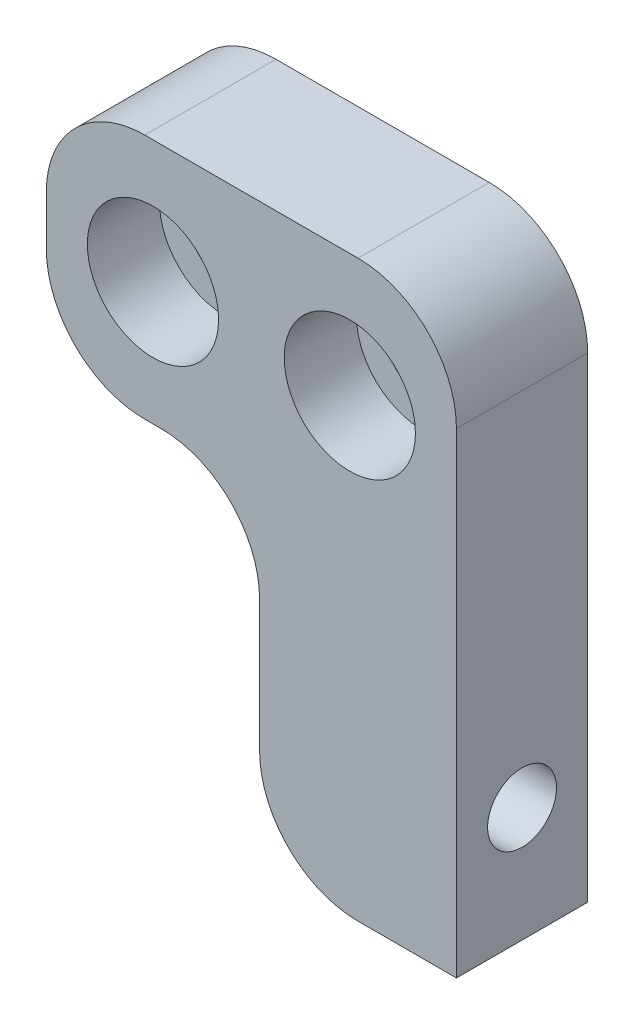
ISO-10303-21;
HEADER;
FILE_DESCRIPTION(('STEP AP214'),'2;1');
FILE_NAME('part.step','',(''),(''),'','','');
FILE_SCHEMA(('AUTOMOTIVE_DESIGN { 1 0 10303 214 1 1 1 1 }'));
ENDSEC;
DATA;
#1=APPLICATION_CONTEXT('core data for automotive mechanical design processes');
#2=APPLICATION_PROTOCOL_DEFINITION('international standard','automotive_design',2000,#1);
#3=PRODUCT_CONTEXT('',#1,'mechanical');
#4=PRODUCT('Part','Part','',(#3));
#5=PRODUCT_RELATED_PRODUCT_CATEGORY('part','',(#4));
#6=PRODUCT_DEFINITION_FORMATION('','',#4);
#7=PRODUCT_DEFINITION_CONTEXT('part definition',#1,'design');
#8=PRODUCT_DEFINITION('design','',#6,#7);
#9=PRODUCT_DEFINITION_SHAPE('','',#8);
#10=(LENGTH_UNIT() NAMED_UNIT(*) SI_UNIT(.MILLI.,.METRE.));
#11=(NAMED_UNIT(*) PLANE_ANGLE_UNIT() SI_UNIT($,.RADIAN.));
#12=(NAMED_UNIT(*) SI_UNIT($,.STERADIAN.) SOLID_ANGLE_UNIT());
#13=UNCERTAINTY_MEASURE_WITH_UNIT(LENGTH_MEASURE(1.E-05),#10,'distance_accuracy_value','');
#14=(GEOMETRIC_REPRESENTATION_CONTEXT(3) GLOBAL_UNCERTAINTY_ASSIGNED_CONTEXT((#13)) GLOBAL_UNIT_ASSIGNED_CONTEXT((#10,
#11,#12)) REPRESENTATION_CONTEXT('',''));
#15=CARTESIAN_POINT('',(0.,0.,0.));
#16=DIRECTION('',(0.,0.,1.));
#17=DIRECTION('',(1.,0.,0.));
#18=AXIS2_PLACEMENT_3D('',#15,#16,#17);
#19=CARTESIAN_POINT('',(6.,6.,8.));
#20=DIRECTION('',(0.,0.,-1.));
#21=DIRECTION('',(-1.,0.,0.));
#22=AXIS2_PLACEMENT_3D('',#19,#20,#21);
#23=CYLINDRICAL_SURFACE('',#22,6.);
#24=DIRECTION('',(0.,0.,-1.));
#25=VECTOR('',#24,1.);
#26=CARTESIAN_POINT('',(0.,6.00000000000004,8.));
#27=LINE('',#26,#25);
#28=CARTESIAN_POINT('',(0.,6.00000000000004,8.));
#29=VERTEX_POINT('',#28);
#30=CARTESIAN_POINT('',(0.,6.00000000000004,5.84661853126196));
#31=VERTEX_POINT('',#30);
#32=EDGE_CURVE('E191',#29,#31,#27,.T.);
#33=ORIENTED_EDGE('',*,*,#32,.T.);
#34=CARTESIAN_POINT('',(0.,6.00000000000004,5.84661853126196));
#35=CARTESIAN_POINT('',(-2.42123116743618E-06,5.94841264548622,5.81868309843425));
#36=CARTESIAN_POINT('',(0.000665680960310724,5.89802565774913,5.78859909007181));
#37=CARTESIAN_POINT('',(0.0031351324375642,5.79997255383219,5.72434664893265));
#38=CARTESIAN_POINT('',(0.0049362119838493,5.75230579296558,5.69017918991266));
#39=CARTESIAN_POINT('',(0.011718000597348,5.61403192308251,5.58200718641706));
#40=CARTESIAN_POINT('',(0.0180790757252985,5.52792266435418,5.50220885330978));
#41=CARTESIAN_POINT('',(0.0326072898947515,5.37030437726796,5.32957583204139));
#42=CARTESIAN_POINT('',(0.0407739569979629,5.29879154313208,5.23674455268875));
#43=CARTESIAN_POINT('',(0.057042321229305,5.1721490550708,5.0404773814718));
#44=CARTESIAN_POINT('',(0.0651440135927151,5.11702059214447,4.93704071942453));
#45=CARTESIAN_POINT('',(0.079708292714416,5.02408889902686,4.72095996515105));
#46=CARTESIAN_POINT('',(0.0861485937918625,4.98651623826522,4.60821504394805));
#47=CARTESIAN_POINT('',(0.0959507971643301,4.93088317491521,4.37787442915162));
#48=CARTESIAN_POINT('',(0.0993128488957042,4.91282182512524,4.26027897132147));
#49=CARTESIAN_POINT('',(0.102270451998787,4.89688975243749,4.025177083098));
#50=CARTESIAN_POINT('',(0.101913075949484,4.89876669940903,3.90768831649214));
#51=CARTESIAN_POINT('',(0.0976153986928007,4.92204267563766,3.67474046753528));
#52=CARTESIAN_POINT('',(0.0936753884410407,4.94344011958174,3.5592812211375));
#53=CARTESIAN_POINT('',(0.0830156192227075,5.00488625856486,3.33439993334599));
#54=CARTESIAN_POINT('',(0.076314175706878,5.04481227737298,3.22494339919144));
#55=CARTESIAN_POINT('',(0.0614389818738308,5.14215163962482,3.01416028613101));
#56=CARTESIAN_POINT('',(0.0532646037755466,5.19957244677906,2.91283720051192));
#57=CARTESIAN_POINT('',(0.0369916681307225,5.3314124738807,2.71947652871819));
#58=CARTESIAN_POINT('',(0.0288965413055166,5.40609452612611,2.62761806151385));
#59=CARTESIAN_POINT('',(0.014877200802447,5.56986749156554,2.45773026355144));
#60=CARTESIAN_POINT('',(0.00894983194418875,5.6589371888568,2.37968091972755));
#61=CARTESIAN_POINT('',(0.00344158708830425,5.79303897891784,2.28080689923267));
#62=CARTESIAN_POINT('',(0.00217792318057366,5.83320921098646,2.25329682507167));
#63=CARTESIAN_POINT('',(0.000457407379120339,5.91531314554378,2.20116394377746));
#64=CARTESIAN_POINT('',(-6.50775293708018E-07,5.95724411505752,2.17653687153262));
#65=CARTESIAN_POINT('',(0.,6.00000000000004,2.15338146873804));
#66=B_SPLINE_CURVE_WITH_KNOTS('',3,(#34,#35,#36,#37,#38,#39,#40,#41,#42,#43,#44,#45,#46,#47,#48,
#49,#50,#51,#52,#53,#54,#55,#56,#57,#58,#59,#60,#61,#62,#63,#64,#65),.UNSPECIFIED.,.F.,.F.,(4,2,
2,2,2,2,2,2,2,2,2,2,2,2,2,4),(0.,0.175879430045885,0.351717002519302,0.702621996536343,
1.05343538063413,1.40427425953297,1.759599647918,2.1149077858012,2.46572471608605,
2.81651315810326,3.1650114860965,3.51365870080047,3.86801224951981,4.22184796302644,
4.3678577940385,4.513648812873),.UNSPECIFIED.);
#67=CARTESIAN_POINT('',(0.,6.00000000000004,2.15338146873804));
#68=VERTEX_POINT('',#67);
#69=EDGE_CURVE('E11',#31,#68,#66,.T.);
#70=ORIENTED_EDGE('',*,*,#69,.T.);
#71=CARTESIAN_POINT('',(0.,6.00000000000004,0.));
#72=VERTEX_POINT('',#71);
#73=EDGE_CURVE('E108',#68,#72,#27,.T.);
#74=ORIENTED_EDGE('',*,*,#73,.T.);
#75=CARTESIAN_POINT('',(6.,6.,0.));
#76=DIRECTION('',(0.,0.,1.));
#77=DIRECTION('',(1.,0.,0.));
#78=AXIS2_PLACEMENT_3D('',#75,#76,#77);
#79=CIRCLE('',#78,6.);
#80=CARTESIAN_POINT('',(6.00000000000004,0.,0.));
#81=VERTEX_POINT('',#80);
#82=EDGE_CURVE('E168',#72,#81,#79,.T.);
#83=ORIENTED_EDGE('',*,*,#82,.T.);
#84=DIRECTION('',(0.,0.,-1.));
#85=VECTOR('',#84,1.);
#86=CARTESIAN_POINT('',(6.00000000000004,0.,8.));
#87=LINE('',#86,#85);
#88=CARTESIAN_POINT('',(6.00000000000004,0.,8.));
#89=VERTEX_POINT('',#88);
#90=EDGE_CURVE('E52',#89,#81,#87,.T.);
#91=ORIENTED_EDGE('',*,*,#90,.F.);
#92=CARTESIAN_POINT('',(6.,6.,8.));
#93=DIRECTION('',(0.,0.,1.));
#94=DIRECTION('',(1.,0.,0.));
#95=AXIS2_PLACEMENT_3D('',#92,#93,#94);
#96=CIRCLE('',#95,6.);
#97=EDGE_CURVE('E190',#29,#89,#96,.T.);
#98=ORIENTED_EDGE('',*,*,#97,.F.);
#99=EDGE_LOOP('',(#33,#70,#74,#83,#91,#98));
#100=FACE_BOUND('',#99,.T.);
#101=ADVANCED_FACE('F39',(#100),#23,.T.);
#102=CARTESIAN_POINT('',(12.,0.,8.));
#103=DIRECTION('',(0.,1.,0.));
#104=DIRECTION('',(-1.,0.,0.));
#105=AXIS2_PLACEMENT_3D('',#102,#103,#104);
#106=PLANE('',#105);
#107=DIRECTION('',(1.,0.,0.));
#108=VECTOR('',#107,1.);
#109=CARTESIAN_POINT('',(12.,0.,0.));
#110=LINE('',#109,#108);
#111=CARTESIAN_POINT('',(12.,0.,0.));
#112=VERTEX_POINT('',#111);
#113=EDGE_CURVE('E170',#81,#112,#110,.T.);
#114=ORIENTED_EDGE('',*,*,#113,.T.);
#115=DIRECTION('',(0.,0.,-1.));
#116=VECTOR('',#115,1.);
#117=CARTESIAN_POINT('',(12.,0.,8.));
#118=LINE('',#117,#116);
#119=CARTESIAN_POINT('',(12.,0.,8.));
#120=VERTEX_POINT('',#119);
#121=EDGE_CURVE('E211',#120,#112,#118,.T.);
#122=ORIENTED_EDGE('',*,*,#121,.F.);
#123=DIRECTION('',(1.,0.,0.));
#124=VECTOR('',#123,1.);
#125=CARTESIAN_POINT('',(12.,0.,8.));
#126=LINE('',#125,#124);
#127=EDGE_CURVE('E117',#89,#120,#126,.T.);
#128=ORIENTED_EDGE('',*,*,#127,.F.);
#129=ORIENTED_EDGE('',*,*,#90,.T.);
#130=EDGE_LOOP('',(#114,#122,#128,#129));
#131=FACE_BOUND('',#130,.T.);
#132=ADVANCED_FACE('F214',(#131),#106,.F.);
#133=CARTESIAN_POINT('',(12.,29.,8.));
#134=DIRECTION('',(-1.,0.,0.));
#135=DIRECTION('',(0.,-1.,0.));
#136=AXIS2_PLACEMENT_3D('',#133,#134,#135);
#137=PLANE('',#136);
#138=CARTESIAN_POINT('',(12.,7.,4.));
#139=DIRECTION('',(1.,0.,0.));
#140=DIRECTION('',(0.,0.,-1.));
#141=AXIS2_PLACEMENT_3D('',#138,#139,#140);
#142=CIRCLE('',#141,2.1);
#143=CARTESIAN_POINT('',(12.,7.,1.9));
#144=VERTEX_POINT('',#143);
#145=EDGE_CURVE('E281',#144,#144,#142,.T.);
#146=ORIENTED_EDGE('',*,*,#145,.F.);
#147=EDGE_LOOP('',(#146));
#148=FACE_BOUND('',#147,.T.);
#149=DIRECTION('',(0.,1.,0.));
#150=VECTOR('',#149,1.);
#151=CARTESIAN_POINT('',(12.,29.,0.));
#152=LINE('',#151,#150);
#153=CARTESIAN_POINT('',(12.,29.,0.));
#154=VERTEX_POINT('',#153);
#155=EDGE_CURVE('E173',#112,#154,#152,.T.);
#156=ORIENTED_EDGE('',*,*,#155,.T.);
#157=DIRECTION('',(0.,0.,-1.));
#158=VECTOR('',#157,1.);
#159=CARTESIAN_POINT('',(12.,29.,8.));
#160=LINE('',#159,#158);
#161=CARTESIAN_POINT('',(12.,29.,8.));
#162=VERTEX_POINT('',#161);
#163=EDGE_CURVE('E208',#162,#154,#160,.T.);
#164=ORIENTED_EDGE('',*,*,#163,.F.);
#165=DIRECTION('',(0.,1.,0.));
#166=VECTOR('',#165,1.);
#167=CARTESIAN_POINT('',(12.,29.,8.));
#168=LINE('',#167,#166);
#169=EDGE_CURVE('E234',#120,#162,#168,.T.);
#170=ORIENTED_EDGE('',*,*,#169,.F.);
#171=ORIENTED_EDGE('',*,*,#121,.T.);
#172=EDGE_LOOP('',(#156,#164,#170,#171));
#173=FACE_BOUND('',#172,.T.);
#174=ADVANCED_FACE('F225',(#148,#173),#137,.F.);
#175=CARTESIAN_POINT('',(6.,29.,8.));
#176=DIRECTION('',(0.,0.,-1.));
#177=DIRECTION('',(-1.,0.,0.));
#178=AXIS2_PLACEMENT_3D('',#175,#176,#177);
#179=CYLINDRICAL_SURFACE('',#178,6.);
#180=CARTESIAN_POINT('',(6.,29.,0.));
#181=DIRECTION('',(0.,0.,1.));
#182=DIRECTION('',(-1.,0.,0.));
#183=AXIS2_PLACEMENT_3D('',#180,#181,#182);
#184=CIRCLE('',#183,6.);
#185=CARTESIAN_POINT('',(6.,35.,0.));
#186=VERTEX_POINT('',#185);
#187=EDGE_CURVE('E175',#154,#186,#184,.T.);
#188=ORIENTED_EDGE('',*,*,#187,.T.);
#189=DIRECTION('',(0.,0.,-1.));
#190=VECTOR('',#189,1.);
#191=CARTESIAN_POINT('',(6.,35.,8.));
#192=LINE('',#191,#190);
#193=CARTESIAN_POINT('',(6.,35.,8.));
#194=VERTEX_POINT('',#193);
#195=EDGE_CURVE('E205',#194,#186,#192,.T.);
#196=ORIENTED_EDGE('',*,*,#195,.F.);
#197=CARTESIAN_POINT('',(6.,29.,8.));
#198=DIRECTION('',(0.,0.,1.));
#199=DIRECTION('',(-1.,0.,0.));
#200=AXIS2_PLACEMENT_3D('',#197,#198,#199);
#201=CIRCLE('',#200,6.);
#202=EDGE_CURVE('E231',#162,#194,#201,.T.);
#203=ORIENTED_EDGE('',*,*,#202,.F.);
#204=ORIENTED_EDGE('',*,*,#163,.T.);
#205=EDGE_LOOP('',(#188,#196,#203,#204));
#206=FACE_BOUND('',#205,.T.);
#207=ADVANCED_FACE('F229',(#206),#179,.T.);
#208=CARTESIAN_POINT('',(-7.,35.,8.));
#209=DIRECTION('',(0.,-1.,0.));
#210=DIRECTION('',(0.,0.,-1.));
#211=AXIS2_PLACEMENT_3D('',#208,#209,#210);
#212=PLANE('',#211);
#213=DIRECTION('',(-1.,0.,0.));
#214=VECTOR('',#213,1.);
#215=CARTESIAN_POINT('',(-7.,35.,0.));
#216=LINE('',#215,#214);
#217=CARTESIAN_POINT('',(-7.,35.,0.));
#218=VERTEX_POINT('',#217);
#219=EDGE_CURVE('E177',#186,#218,#216,.T.);
#220=ORIENTED_EDGE('',*,*,#219,.T.);
#221=DIRECTION('',(0.,0.,-1.));
#222=VECTOR('',#221,1.);
#223=CARTESIAN_POINT('',(-7.,35.,8.));
#224=LINE('',#223,#222);
#225=CARTESIAN_POINT('',(-7.,35.,8.));
#226=VERTEX_POINT('',#225);
#227=EDGE_CURVE('E202',#226,#218,#224,.T.);
#228=ORIENTED_EDGE('',*,*,#227,.F.);
#229=DIRECTION('',(-1.,0.,0.));
#230=VECTOR('',#229,1.);
#231=CARTESIAN_POINT('',(-7.,35.,8.));
#232=LINE('',#231,#230);
#233=EDGE_CURVE('E233',#194,#226,#232,.T.);
#234=ORIENTED_EDGE('',*,*,#233,.F.);
#235=ORIENTED_EDGE('',*,*,#195,.T.);
#236=EDGE_LOOP('',(#220,#228,#234,#235));
#237=FACE_BOUND('',#236,.T.);
#238=ADVANCED_FACE('F293',(#237),#212,.F.);
#239=CARTESIAN_POINT('',(-7.,29.,8.));
#240=DIRECTION('',(0.,0.,-1.));
#241=DIRECTION('',(-1.,0.,0.));
#242=AXIS2_PLACEMENT_3D('',#239,#240,#241);
#243=CYLINDRICAL_SURFACE('',#242,6.);
#244=CARTESIAN_POINT('',(-7.,29.,0.));
#245=DIRECTION('',(0.,0.,1.));
#246=DIRECTION('',(-1.,0.,0.));
#247=AXIS2_PLACEMENT_3D('',#244,#245,#246);
#248=CIRCLE('',#247,6.);
#249=CARTESIAN_POINT('',(-13.,29.,0.));
#250=VERTEX_POINT('',#249);
#251=EDGE_CURVE('E179',#218,#250,#248,.T.);
#252=ORIENTED_EDGE('',*,*,#251,.T.);
#253=DIRECTION('',(0.,0.,-1.));
#254=VECTOR('',#253,1.);
#255=CARTESIAN_POINT('',(-13.,29.,8.));
#256=LINE('',#255,#254);
#257=CARTESIAN_POINT('',(-13.,29.,8.));
#258=VERTEX_POINT('',#257);
#259=EDGE_CURVE('E199',#258,#250,#256,.T.);
#260=ORIENTED_EDGE('',*,*,#259,.F.);
#261=CARTESIAN_POINT('',(-7.,29.,8.));
#262=DIRECTION('',(0.,0.,1.));
#263=DIRECTION('',(-1.,0.,0.));
#264=AXIS2_PLACEMENT_3D('',#261,#262,#263);
#265=CIRCLE('',#264,6.);
#266=EDGE_CURVE('E236',#226,#258,#265,.T.);
#267=ORIENTED_EDGE('',*,*,#266,.F.);
#268=ORIENTED_EDGE('',*,*,#227,.T.);
#269=EDGE_LOOP('',(#252,#260,#267,#268));
#270=FACE_BOUND('',#269,.T.);
#271=ADVANCED_FACE('F320',(#270),#243,.T.);
#272=CARTESIAN_POINT('',(-13.,26.,8.));
#273=DIRECTION('',(1.,0.,0.));
#274=DIRECTION('',(0.,0.,-1.));
#275=AXIS2_PLACEMENT_3D('',#272,#273,#274);
#276=PLANE('',#275);
#277=DIRECTION('',(0.,-1.,0.));
#278=VECTOR('',#277,1.);
#279=CARTESIAN_POINT('',(-13.,26.,0.));
#280=LINE('',#279,#278);
#281=CARTESIAN_POINT('',(-13.,26.,0.));
#282=VERTEX_POINT('',#281);
#283=EDGE_CURVE('E181',#250,#282,#280,.T.);
#284=ORIENTED_EDGE('',*,*,#283,.T.);
#285=DIRECTION('',(0.,0.,-1.));
#286=VECTOR('',#285,1.);
#287=CARTESIAN_POINT('',(-13.,26.,8.));
#288=LINE('',#287,#286);
#289=CARTESIAN_POINT('',(-13.,26.,8.));
#290=VERTEX_POINT('',#289);
#291=EDGE_CURVE('E196',#290,#282,#288,.T.);
#292=ORIENTED_EDGE('',*,*,#291,.F.);
#293=DIRECTION('',(0.,-1.,0.));
#294=VECTOR('',#293,1.);
#295=CARTESIAN_POINT('',(-13.,26.,8.));
#296=LINE('',#295,#294);
#297=EDGE_CURVE('E242',#258,#290,#296,.T.);
#298=ORIENTED_EDGE('',*,*,#297,.F.);
#299=ORIENTED_EDGE('',*,*,#259,.T.);
#300=EDGE_LOOP('',(#284,#292,#298,#299));
#301=FACE_BOUND('',#300,.T.);
#302=ADVANCED_FACE('F248',(#301),#276,.F.);
#303=CARTESIAN_POINT('',(-7.,26.,8.));
#304=DIRECTION('',(0.,0.,-1.));
#305=DIRECTION('',(-1.,0.,0.));
#306=AXIS2_PLACEMENT_3D('',#303,#304,#305);
#307=CYLINDRICAL_SURFACE('',#306,6.);
#308=CARTESIAN_POINT('',(-7.,26.,0.));
#309=DIRECTION('',(0.,0.,1.));
#310=DIRECTION('',(-1.,0.,0.));
#311=AXIS2_PLACEMENT_3D('',#308,#309,#310);
#312=CIRCLE('',#311,6.);
#313=CARTESIAN_POINT('',(-7.,20.,0.));
#314=VERTEX_POINT('',#313);
#315=EDGE_CURVE('E183',#282,#314,#312,.T.);
#316=ORIENTED_EDGE('',*,*,#315,.T.);
#317=DIRECTION('',(0.,0.,-1.));
#318=VECTOR('',#317,1.);
#319=CARTESIAN_POINT('',(-7.,20.,8.));
#320=LINE('',#319,#318);
#321=CARTESIAN_POINT('',(-7.,20.,8.));
#322=VERTEX_POINT('',#321);
#323=EDGE_CURVE('E159',#322,#314,#320,.T.);
#324=ORIENTED_EDGE('',*,*,#323,.F.);
#325=CARTESIAN_POINT('',(-7.,26.,8.));
#326=DIRECTION('',(0.,0.,1.));
#327=DIRECTION('',(-1.,0.,0.));
#328=AXIS2_PLACEMENT_3D('',#325,#326,#327);
#329=CIRCLE('',#328,6.);
#330=EDGE_CURVE('E147',#290,#322,#329,.T.);
#331=ORIENTED_EDGE('',*,*,#330,.F.);
#332=ORIENTED_EDGE('',*,*,#291,.T.);
#333=EDGE_LOOP('',(#316,#324,#331,#332));
#334=FACE_BOUND('',#333,.T.);
#335=ADVANCED_FACE('F252',(#334),#307,.T.);
#336=CARTESIAN_POINT('',(-6.,20.,8.));
#337=DIRECTION('',(0.,1.,0.));
#338=DIRECTION('',(-1.,0.,0.));
#339=AXIS2_PLACEMENT_3D('',#336,#337,#338);
#340=PLANE('',#339);
#341=DIRECTION('',(1.,0.,0.));
#342=VECTOR('',#341,1.);
#343=CARTESIAN_POINT('',(-6.,20.,0.));
#344=LINE('',#343,#342);
#345=CARTESIAN_POINT('',(-6.,20.,0.));
#346=VERTEX_POINT('',#345);
#347=EDGE_CURVE('E156',#314,#346,#344,.T.);
#348=ORIENTED_EDGE('',*,*,#347,.T.);
#349=DIRECTION('',(0.,0.,-1.));
#350=VECTOR('',#349,1.);
#351=CARTESIAN_POINT('',(-6.,20.,8.));
#352=LINE('',#351,#350);
#353=CARTESIAN_POINT('',(-6.,20.,8.));
#354=VERTEX_POINT('',#353);
#355=EDGE_CURVE('E153',#354,#346,#352,.T.);
#356=ORIENTED_EDGE('',*,*,#355,.F.);
#357=DIRECTION('',(1.,0.,0.));
#358=VECTOR('',#357,1.);
#359=CARTESIAN_POINT('',(-6.,20.,8.));
#360=LINE('',#359,#358);
#361=EDGE_CURVE('E140',#322,#354,#360,.T.);
#362=ORIENTED_EDGE('',*,*,#361,.F.);
#363=ORIENTED_EDGE('',*,*,#323,.T.);
#364=EDGE_LOOP('',(#348,#356,#362,#363));
#365=FACE_BOUND('',#364,.T.);
#366=ADVANCED_FACE('F154',(#365),#340,.F.);
#367=CARTESIAN_POINT('',(-6.,14.,8.));
#368=DIRECTION('',(0.,0.,-1.));
#369=DIRECTION('',(-1.,0.,0.));
#370=AXIS2_PLACEMENT_3D('',#367,#368,#369);
#371=CYLINDRICAL_SURFACE('',#370,6.);
#372=CARTESIAN_POINT('',(-6.,14.,0.));
#373=DIRECTION('',(0.,0.,-1.));
#374=DIRECTION('',(1.,0.,0.));
#375=AXIS2_PLACEMENT_3D('',#372,#373,#374);
#376=CIRCLE('',#375,6.);
#377=CARTESIAN_POINT('',(0.,14.,0.));
#378=VERTEX_POINT('',#377);
#379=EDGE_CURVE('E186',#346,#378,#376,.T.);
#380=ORIENTED_EDGE('',*,*,#379,.T.);
#381=DIRECTION('',(0.,0.,-1.));
#382=VECTOR('',#381,1.);
#383=CARTESIAN_POINT('',(0.,14.,8.));
#384=LINE('',#383,#382);
#385=CARTESIAN_POINT('',(0.,14.,8.));
#386=VERTEX_POINT('',#385);
#387=EDGE_CURVE('E160',#386,#378,#384,.T.);
#388=ORIENTED_EDGE('',*,*,#387,.F.);
#389=CARTESIAN_POINT('',(-6.,14.,8.));
#390=DIRECTION('',(0.,0.,-1.));
#391=DIRECTION('',(1.,0.,0.));
#392=AXIS2_PLACEMENT_3D('',#389,#390,#391);
#393=CIRCLE('',#392,6.);
#394=EDGE_CURVE('E144',#354,#386,#393,.T.);
#395=ORIENTED_EDGE('',*,*,#394,.F.);
#396=ORIENTED_EDGE('',*,*,#355,.T.);
#397=EDGE_LOOP('',(#380,#388,#395,#396));
#398=FACE_BOUND('',#397,.T.);
#399=ADVANCED_FACE('F162',(#398),#371,.F.);
#400=CARTESIAN_POINT('',(0.,6.00000000000004,8.));
#401=DIRECTION('',(1.,0.,0.));
#402=DIRECTION('',(0.,0.,-1.));
#403=AXIS2_PLACEMENT_3D('',#400,#401,#402);
#404=PLANE('',#403);
#405=ORIENTED_EDGE('',*,*,#73,.F.);
#406=CARTESIAN_POINT('',(0.,7.,4.));
#407=DIRECTION('',(1.,0.,0.));
#408=DIRECTION('',(0.,0.,-1.));
#409=AXIS2_PLACEMENT_3D('',#406,#407,#408);
#410=CIRCLE('',#409,2.1);
#411=EDGE_CURVE('E58',#68,#31,#410,.T.);
#412=ORIENTED_EDGE('',*,*,#411,.T.);
#413=ORIENTED_EDGE('',*,*,#32,.F.);
#414=DIRECTION('',(0.,-1.,0.));
#415=VECTOR('',#414,1.);
#416=CARTESIAN_POINT('',(0.,6.00000000000004,8.));
#417=LINE('',#416,#415);
#418=EDGE_CURVE('E66',#386,#29,#417,.T.);
#419=ORIENTED_EDGE('',*,*,#418,.F.);
#420=ORIENTED_EDGE('',*,*,#387,.T.);
#421=DIRECTION('',(0.,-1.,0.));
#422=VECTOR('',#421,1.);
#423=CARTESIAN_POINT('',(0.,6.00000000000004,0.));
#424=LINE('',#423,#422);
#425=EDGE_CURVE('E188',#378,#72,#424,.T.);
#426=ORIENTED_EDGE('',*,*,#425,.T.);
#427=EDGE_LOOP('',(#405,#412,#413,#419,#420,#426));
#428=FACE_BOUND('',#427,.T.);
#429=ADVANCED_FACE('F254',(#428),#404,.F.);
#430=CARTESIAN_POINT('',(6.,6.,8.));
#431=DIRECTION('',(0.,0.,1.));
#432=DIRECTION('',(1.,0.,0.));
#433=AXIS2_PLACEMENT_3D('',#430,#431,#432);
#434=PLANE('',#433);
#435=CARTESIAN_POINT('',(-6.5,27.5,8.));
#436=DIRECTION('',(0.,0.,1.));
#437=DIRECTION('',(1.,0.,0.));
#438=AXIS2_PLACEMENT_3D('',#435,#436,#437);
#439=CIRCLE('',#438,4.);
#440=CARTESIAN_POINT('',(-2.5,27.5,8.));
#441=VERTEX_POINT('',#440);
#442=EDGE_CURVE('E277',#441,#441,#439,.T.);
#443=ORIENTED_EDGE('',*,*,#442,.F.);
#444=EDGE_LOOP('',(#443));
#445=FACE_BOUND('',#444,.T.);
#446=CARTESIAN_POINT('',(5.5,27.5,8.));
#447=DIRECTION('',(0.,0.,1.));
#448=DIRECTION('',(1.,0.,0.));
#449=AXIS2_PLACEMENT_3D('',#446,#447,#448);
#450=CIRCLE('',#449,4.);
#451=CARTESIAN_POINT('',(9.5,27.5,8.));
#452=VERTEX_POINT('',#451);
#453=EDGE_CURVE('E265',#452,#452,#450,.T.);
#454=ORIENTED_EDGE('',*,*,#453,.F.);
#455=EDGE_LOOP('',(#454));
#456=FACE_BOUND('',#455,.T.);
#457=ORIENTED_EDGE('',*,*,#97,.T.);
#458=ORIENTED_EDGE('',*,*,#127,.T.);
#459=ORIENTED_EDGE('',*,*,#169,.T.);
#460=ORIENTED_EDGE('',*,*,#202,.T.);
#461=ORIENTED_EDGE('',*,*,#233,.T.);
#462=ORIENTED_EDGE('',*,*,#266,.T.);
#463=ORIENTED_EDGE('',*,*,#297,.T.);
#464=ORIENTED_EDGE('',*,*,#330,.T.);
#465=ORIENTED_EDGE('',*,*,#361,.T.);
#466=ORIENTED_EDGE('',*,*,#394,.T.);
#467=ORIENTED_EDGE('',*,*,#418,.T.);
#468=EDGE_LOOP('',(#457,#458,#459,#460,#461,#462,#463,#464,#465,#466,#467));
#469=FACE_BOUND('',#468,.T.);
#470=ADVANCED_FACE('F142',(#445,#456,#469),#434,.T.);
#471=CARTESIAN_POINT('',(6.,6.,0.));
#472=DIRECTION('',(0.,0.,1.));
#473=DIRECTION('',(1.,0.,0.));
#474=AXIS2_PLACEMENT_3D('',#471,#472,#473);
#475=PLANE('',#474);
#476=CARTESIAN_POINT('',(-6.5,27.5,0.));
#477=DIRECTION('',(0.,0.,1.));
#478=DIRECTION('',(1.,0.,0.));
#479=AXIS2_PLACEMENT_3D('',#476,#477,#478);
#480=CIRCLE('',#479,2.25);
#481=CARTESIAN_POINT('',(-4.25,27.5,0.));
#482=VERTEX_POINT('',#481);
#483=EDGE_CURVE('E268',#482,#482,#480,.T.);
#484=ORIENTED_EDGE('',*,*,#483,.T.);
#485=EDGE_LOOP('',(#484));
#486=FACE_BOUND('',#485,.T.);
#487=CARTESIAN_POINT('',(5.5,27.5,0.));
#488=DIRECTION('',(0.,0.,1.));
#489=DIRECTION('',(1.,0.,0.));
#490=AXIS2_PLACEMENT_3D('',#487,#488,#489);
#491=CIRCLE('',#490,2.25);
#492=CARTESIAN_POINT('',(7.75,27.5,0.));
#493=VERTEX_POINT('',#492);
#494=EDGE_CURVE('E171',#493,#493,#491,.T.);
#495=ORIENTED_EDGE('',*,*,#494,.T.);
#496=EDGE_LOOP('',(#495));
#497=FACE_BOUND('',#496,.T.);
#498=ORIENTED_EDGE('',*,*,#82,.F.);
#499=ORIENTED_EDGE('',*,*,#425,.F.);
#500=ORIENTED_EDGE('',*,*,#379,.F.);
#501=ORIENTED_EDGE('',*,*,#347,.F.);
#502=ORIENTED_EDGE('',*,*,#315,.F.);
#503=ORIENTED_EDGE('',*,*,#283,.F.);
#504=ORIENTED_EDGE('',*,*,#251,.F.);
#505=ORIENTED_EDGE('',*,*,#219,.F.);
#506=ORIENTED_EDGE('',*,*,#187,.F.);
#507=ORIENTED_EDGE('',*,*,#155,.F.);
#508=ORIENTED_EDGE('',*,*,#113,.F.);
#509=EDGE_LOOP('',(#498,#499,#500,#501,#502,#503,#504,#505,#506,#507,#508));
#510=FACE_BOUND('',#509,.T.);
#511=ADVANCED_FACE('F219',(#486,#497,#510),#475,.F.);
#512=CARTESIAN_POINT('',(5.5,27.5,8.));
#513=DIRECTION('',(0.,0.,1.));
#514=DIRECTION('',(1.,0.,0.));
#515=AXIS2_PLACEMENT_3D('',#512,#513,#514);
#516=CYLINDRICAL_SURFACE('',#515,2.25);
#517=ORIENTED_EDGE('',*,*,#494,.F.);
#518=EDGE_LOOP('',(#517));
#519=FACE_BOUND('',#518,.T.);
#520=CARTESIAN_POINT('',(5.5,27.5,3.6));
#521=DIRECTION('',(0.,0.,1.));
#522=DIRECTION('',(1.,0.,0.));
#523=AXIS2_PLACEMENT_3D('',#520,#521,#522);
#524=CIRCLE('',#523,2.25);
#525=CARTESIAN_POINT('',(7.75,27.5,3.6));
#526=VERTEX_POINT('',#525);
#527=EDGE_CURVE('E259',#526,#526,#524,.T.);
#528=ORIENTED_EDGE('',*,*,#527,.T.);
#529=EDGE_LOOP('',(#528));
#530=FACE_BOUND('',#529,.T.);
#531=ADVANCED_FACE('F382',(#519,#530),#516,.F.);
#532=CARTESIAN_POINT('',(7.75,27.5,3.6));
#533=DIRECTION('',(0.,0.,-1.));
#534=DIRECTION('',(-1.,0.,0.));
#535=AXIS2_PLACEMENT_3D('',#532,#533,#534);
#536=PLANE('',#535);
#537=ORIENTED_EDGE('',*,*,#527,.F.);
#538=EDGE_LOOP('',(#537));
#539=FACE_BOUND('',#538,.T.);
#540=CARTESIAN_POINT('',(5.5,27.5,3.6));
#541=DIRECTION('',(0.,0.,1.));
#542=DIRECTION('',(1.,0.,0.));
#543=AXIS2_PLACEMENT_3D('',#540,#541,#542);
#544=CIRCLE('',#543,4.);
#545=CARTESIAN_POINT('',(9.5,27.5,3.6));
#546=VERTEX_POINT('',#545);
#547=EDGE_CURVE('E262',#546,#546,#544,.T.);
#548=ORIENTED_EDGE('',*,*,#547,.T.);
#549=EDGE_LOOP('',(#548));
#550=FACE_BOUND('',#549,.T.);
#551=ADVANCED_FACE('F392',(#539,#550),#536,.F.);
#552=CARTESIAN_POINT('',(5.5,27.5,8.));
#553=DIRECTION('',(0.,0.,1.));
#554=DIRECTION('',(1.,0.,0.));
#555=AXIS2_PLACEMENT_3D('',#552,#553,#554);
#556=CYLINDRICAL_SURFACE('',#555,4.);
#557=ORIENTED_EDGE('',*,*,#547,.F.);
#558=EDGE_LOOP('',(#557));
#559=FACE_BOUND('',#558,.T.);
#560=ORIENTED_EDGE('',*,*,#453,.T.);
#561=EDGE_LOOP('',(#560));
#562=FACE_BOUND('',#561,.T.);
#563=ADVANCED_FACE('F402',(#559,#562),#556,.F.);
#564=CARTESIAN_POINT('',(-6.5,27.5,8.));
#565=DIRECTION('',(0.,0.,1.));
#566=DIRECTION('',(1.,0.,0.));
#567=AXIS2_PLACEMENT_3D('',#564,#565,#566);
#568=CYLINDRICAL_SURFACE('',#567,2.25);
#569=ORIENTED_EDGE('',*,*,#483,.F.);
#570=EDGE_LOOP('',(#569));
#571=FACE_BOUND('',#570,.T.);
#572=CARTESIAN_POINT('',(-6.5,27.5,3.6));
#573=DIRECTION('',(0.,0.,1.));
#574=DIRECTION('',(1.,0.,0.));
#575=AXIS2_PLACEMENT_3D('',#572,#573,#574);
#576=CIRCLE('',#575,2.25);
#577=CARTESIAN_POINT('',(-4.25,27.5,3.6));
#578=VERTEX_POINT('',#577);
#579=EDGE_CURVE('E271',#578,#578,#576,.T.);
#580=ORIENTED_EDGE('',*,*,#579,.T.);
#581=EDGE_LOOP('',(#580));
#582=FACE_BOUND('',#581,.T.);
#583=ADVANCED_FACE('F412',(#571,#582),#568,.F.);
#584=CARTESIAN_POINT('',(-4.25,27.5,3.6));
#585=DIRECTION('',(0.,0.,-1.));
#586=DIRECTION('',(-1.,0.,0.));
#587=AXIS2_PLACEMENT_3D('',#584,#585,#586);
#588=PLANE('',#587);
#589=ORIENTED_EDGE('',*,*,#579,.F.);
#590=EDGE_LOOP('',(#589));
#591=FACE_BOUND('',#590,.T.);
#592=CARTESIAN_POINT('',(-6.5,27.5,3.6));
#593=DIRECTION('',(0.,0.,1.));
#594=DIRECTION('',(1.,0.,0.));
#595=AXIS2_PLACEMENT_3D('',#592,#593,#594);
#596=CIRCLE('',#595,4.);
#597=CARTESIAN_POINT('',(-2.5,27.5,3.6));
#598=VERTEX_POINT('',#597);
#599=EDGE_CURVE('E274',#598,#598,#596,.T.);
#600=ORIENTED_EDGE('',*,*,#599,.T.);
#601=EDGE_LOOP('',(#600));
#602=FACE_BOUND('',#601,.T.);
#603=ADVANCED_FACE('F422',(#591,#602),#588,.F.);
#604=CARTESIAN_POINT('',(-6.5,27.5,8.));
#605=DIRECTION('',(0.,0.,1.));
#606=DIRECTION('',(1.,0.,0.));
#607=AXIS2_PLACEMENT_3D('',#604,#605,#606);
#608=CYLINDRICAL_SURFACE('',#607,4.);
#609=ORIENTED_EDGE('',*,*,#599,.F.);
#610=EDGE_LOOP('',(#609));
#611=FACE_BOUND('',#610,.T.);
#612=ORIENTED_EDGE('',*,*,#442,.T.);
#613=EDGE_LOOP('',(#612));
#614=FACE_BOUND('',#613,.T.);
#615=ADVANCED_FACE('F431',(#611,#614),#608,.F.);
#616=CARTESIAN_POINT('',(12.,7.,4.));
#617=DIRECTION('',(1.,0.,0.));
#618=DIRECTION('',(0.,0.,-1.));
#619=AXIS2_PLACEMENT_3D('',#616,#617,#618);
#620=CYLINDRICAL_SURFACE('',#619,2.1);
#621=ORIENTED_EDGE('',*,*,#145,.T.);
#622=EDGE_LOOP('',(#621));
#623=FACE_BOUND('',#622,.T.);
#624=ORIENTED_EDGE('',*,*,#69,.F.);
#625=ORIENTED_EDGE('',*,*,#411,.F.);
#626=EDGE_LOOP('',(#624,#625));
#627=FACE_BOUND('',#626,.T.);
#628=ADVANCED_FACE('F285',(#623,#627),#620,.F.);
#629=CLOSED_SHELL('',(#101,#132,#174,#207,#238,#271,#302,#335,#366,#399,#429,#470,#511,#531,
#551,#563,#583,#603,#615,#628));
#630=MANIFOLD_SOLID_BREP('B2',#629);
#631=ADVANCED_BREP_SHAPE_REPRESENTATION('',(#18,#630),#14);
#632=SHAPE_DEFINITION_REPRESENTATION(#9,#631);
ENDSEC;
END-ISO-10303-21;
